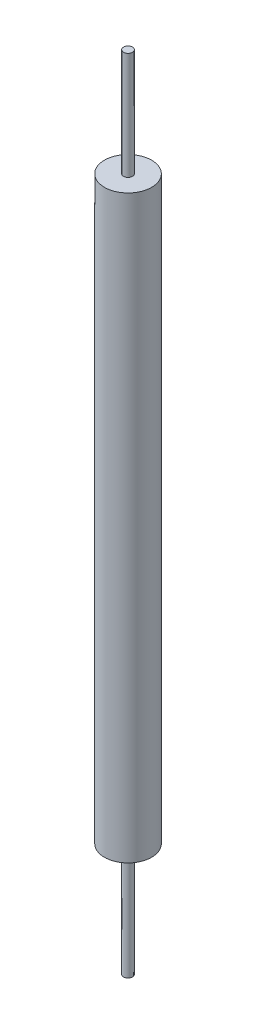
ISO-10303-21;
HEADER;
FILE_DESCRIPTION(('STEP AP214'),'2;1');
FILE_NAME('part.step','',(''),(''),'','','');
FILE_SCHEMA(('AUTOMOTIVE_DESIGN { 1 0 10303 214 1 1 1 1 }'));
ENDSEC;
DATA;
#1=APPLICATION_CONTEXT('core data for automotive mechanical design processes');
#2=APPLICATION_PROTOCOL_DEFINITION('international standard','automotive_design',2000,#1);
#3=PRODUCT_CONTEXT('',#1,'mechanical');
#4=PRODUCT('Part','Part','',(#3));
#5=PRODUCT_RELATED_PRODUCT_CATEGORY('part','',(#4));
#6=PRODUCT_DEFINITION_FORMATION('','',#4);
#7=PRODUCT_DEFINITION_CONTEXT('part definition',#1,'design');
#8=PRODUCT_DEFINITION('design','',#6,#7);
#9=PRODUCT_DEFINITION_SHAPE('','',#8);
#10=(LENGTH_UNIT() NAMED_UNIT(*) SI_UNIT(.MILLI.,.METRE.));
#11=(NAMED_UNIT(*) PLANE_ANGLE_UNIT() SI_UNIT($,.RADIAN.));
#12=(NAMED_UNIT(*) SI_UNIT($,.STERADIAN.) SOLID_ANGLE_UNIT());
#13=UNCERTAINTY_MEASURE_WITH_UNIT(LENGTH_MEASURE(1.E-05),#10,'distance_accuracy_value','');
#14=(GEOMETRIC_REPRESENTATION_CONTEXT(3) GLOBAL_UNCERTAINTY_ASSIGNED_CONTEXT((#13)) GLOBAL_UNIT_ASSIGNED_CONTEXT((#10,
#11,#12)) REPRESENTATION_CONTEXT('',''));
#15=CARTESIAN_POINT('',(0.,0.,0.));
#16=DIRECTION('',(0.,0.,1.));
#17=DIRECTION('',(1.,0.,0.));
#18=AXIS2_PLACEMENT_3D('',#15,#16,#17);
#19=CARTESIAN_POINT('',(0.,789.6,0.));
#20=DIRECTION('',(0.,-1.,0.));
#21=DIRECTION('',(0.,0.,-1.));
#22=AXIS2_PLACEMENT_3D('',#19,#20,#21);
#23=CYLINDRICAL_SURFACE('',#22,25.);
#24=CARTESIAN_POINT('',(-24.4803692447999,337.95,-5.07065297947487));
#25=CARTESIAN_POINT('',(-24.4803704267924,338.033065530407,-5.07064911676483));
#26=CARTESIAN_POINT('',(-24.4818068726829,338.116190178673,-5.06372760055706));
#27=CARTESIAN_POINT('',(-24.4874759549728,338.280119313694,-5.03623969692189));
#28=CARTESIAN_POINT('',(-24.4917118818056,338.360920953286,-5.01565725269049));
#29=CARTESIAN_POINT('',(-24.5027368802839,338.517779948416,-4.96151622023754));
#30=CARTESIAN_POINT('',(-24.5095234168622,338.593841927512,-4.9279705153522));
#31=CARTESIAN_POINT('',(-24.5252820496748,338.739204717167,-4.84893353769242));
#32=CARTESIAN_POINT('',(-24.5342537492403,338.808506751651,-4.80344443286503));
#33=CARTESIAN_POINT('',(-24.5540326777045,338.939239724926,-4.70129837287459));
#34=CARTESIAN_POINT('',(-24.5648585181909,339.000578516605,-4.64452713848332));
#35=CARTESIAN_POINT('',(-24.5877554160779,339.11290568262,-4.52174491900959));
#36=CARTESIAN_POINT('',(-24.5998266306454,339.163892748148,-4.45573276734266));
#37=CARTESIAN_POINT('',(-24.6249023775349,339.255018597438,-4.31501722372393));
#38=CARTESIAN_POINT('',(-24.6379198358369,339.294944640868,-4.24017830420548));
#39=CARTESIAN_POINT('',(-24.6641433208564,339.361635534538,-4.0848783618945));
#40=CARTESIAN_POINT('',(-24.6773493592774,339.38839956425,-4.00441698895161));
#41=CARTESIAN_POINT('',(-24.7035764924574,339.428207283448,-3.83931697725933));
#42=CARTESIAN_POINT('',(-24.7165946931602,339.441120008142,-3.75464625138994));
#43=CARTESIAN_POINT('',(-24.7418818433871,339.452367279242,-3.5842295946693));
#44=CARTESIAN_POINT('',(-24.7541508003015,339.450701969465,-3.49848367443349));
#45=CARTESIAN_POINT('',(-24.7775641211904,339.432797839342,-3.32861065498108));
#46=CARTESIAN_POINT('',(-24.7887114869051,339.416599134868,-3.24447975040534));
#47=CARTESIAN_POINT('',(-24.8096794134416,339.370071842725,-3.08004553588936));
#48=CARTESIAN_POINT('',(-24.8195000361463,339.339743914376,-2.99974204754115));
#49=CARTESIAN_POINT('',(-24.8375915214667,339.266108721899,-2.84604775343688));
#50=CARTESIAN_POINT('',(-24.8458757187957,339.222922526852,-2.7726005127615));
#51=CARTESIAN_POINT('',(-24.8609550304553,339.124664856472,-2.63396742531102));
#52=CARTESIAN_POINT('',(-24.8677502122082,339.0695939195,-2.56878120453549));
#53=CARTESIAN_POINT('',(-24.8798208254829,338.949624445389,-2.44910440002238));
#54=CARTESIAN_POINT('',(-24.885108288795,338.884810401376,-2.39453031236309));
#55=CARTESIAN_POINT('',(-24.8942986921019,338.746863743013,-2.29701960614495));
#56=CARTESIAN_POINT('',(-24.8982016667972,338.673731337213,-2.25408269592217));
#57=CARTESIAN_POINT('',(-24.9046861662216,338.521576783484,-2.1812711183625));
#58=CARTESIAN_POINT('',(-24.9072734714972,338.442582178173,-2.15133939718838));
#59=CARTESIAN_POINT('',(-24.9112214899481,338.280665675092,-2.10513329585162));
#60=CARTESIAN_POINT('',(-24.9125822155125,338.197743816999,-2.08885877774148));
#61=CARTESIAN_POINT('',(-24.9141185392938,338.03046832571,-2.07045509423179));
#62=CARTESIAN_POINT('',(-24.9142960195781,337.946117180329,-2.0683034650789));
#63=CARTESIAN_POINT('',(-24.9134767587728,337.778250503633,-2.07814802502549));
#64=CARTESIAN_POINT('',(-24.9124800222717,337.694734969054,-2.0901441588402));
#65=CARTESIAN_POINT('',(-24.9092807139069,337.530934942154,-2.12793089374339));
#66=CARTESIAN_POINT('',(-24.9070784906104,337.450649523043,-2.15371750725676));
#67=CARTESIAN_POINT('',(-24.9014063550025,337.29556033597,-2.21833434443576));
#68=CARTESIAN_POINT('',(-24.8979364462794,337.220756552491,-2.25716453117943));
#69=CARTESIAN_POINT('',(-24.889650712723,337.078706154892,-2.34676475551543));
#70=CARTESIAN_POINT('',(-24.8848341682303,337.011463608612,-2.39754117502047));
#71=CARTESIAN_POINT('',(-24.8737881741133,336.886471072753,-2.50954580184231));
#72=CARTESIAN_POINT('',(-24.8675587202911,336.828721111379,-2.57077404021256));
#73=CARTESIAN_POINT('',(-24.8536372629654,336.724201098244,-2.70204967939455));
#74=CARTESIAN_POINT('',(-24.8459421175316,336.677455125513,-2.77211591476229));
#75=CARTESIAN_POINT('',(-24.829121245653,336.596375565738,-2.9189367001778));
#76=CARTESIAN_POINT('',(-24.8199954902263,336.5620422302,-2.9956913857094));
#77=CARTESIAN_POINT('',(-24.8003609198475,336.506536441048,-3.15412404735377));
#78=CARTESIAN_POINT('',(-24.7898449013285,336.485436069496,-3.23582637474279));
#79=CARTESIAN_POINT('',(-24.7676617751902,336.457206775572,-3.40145710624222));
#80=CARTESIAN_POINT('',(-24.7559946086533,336.450078568707,-3.48538562413183));
#81=CARTESIAN_POINT('',(-24.73169011637,336.449922035599,-3.65387631992));
#82=CARTESIAN_POINT('',(-24.7190450914878,336.457019555396,-3.73843750194549));
#83=CARTESIAN_POINT('',(-24.6932658373663,336.485317098187,-3.90509104650278));
#84=CARTESIAN_POINT('',(-24.680131578104,336.506517988017,-3.98718325695974));
#85=CARTESIAN_POINT('',(-24.6537322653682,336.562653173938,-4.14730374588743));
#86=CARTESIAN_POINT('',(-24.6404670389214,336.597701177347,-4.22529215891913));
#87=CARTESIAN_POINT('',(-24.6144582672907,336.680560475987,-4.37426207848779));
#88=CARTESIAN_POINT('',(-24.6017147155293,336.728371610242,-4.44524367338432));
#89=CARTESIAN_POINT('',(-24.5773234515305,336.835472013344,-4.57818167207155));
#90=CARTESIAN_POINT('',(-24.5656758810786,336.894762764267,-4.64013690870232));
#91=CARTESIAN_POINT('',(-24.54405238671,337.023217592041,-4.75318994965592));
#92=CARTESIAN_POINT('',(-24.5340767691985,337.092383474334,-4.80428576432043));
#93=CARTESIAN_POINT('',(-24.5164396634024,337.237754252994,-4.89348912576956));
#94=CARTESIAN_POINT('',(-24.5087521361726,337.313865952268,-4.93174350667504));
#95=CARTESIAN_POINT('',(-24.4959709300234,337.471587956726,-4.99484287806743));
#96=CARTESIAN_POINT('',(-24.4908737995086,337.553190780064,-5.01970571488577));
#97=CARTESIAN_POINT('',(-24.4849498934101,337.6877964892,-5.04849934136941));
#98=CARTESIAN_POINT('',(-24.4832362152097,337.739867482485,-5.05679510872545));
#99=CARTESIAN_POINT('',(-24.4809455234018,337.844617723039,-5.06787311694184));
#100=CARTESIAN_POINT('',(-24.4803684948546,337.897296962305,-5.07065543026946));
#101=CARTESIAN_POINT('',(-24.4803692447999,337.95,-5.07065297947487));
#102=B_SPLINE_CURVE_WITH_KNOTS('',3,(#24,#25,#26,#27,#28,#29,#30,#31,#32,#33,#34,#35,#36,#37,
#38,#39,#40,#41,#42,#43,#44,#45,#46,#47,#48,#49,#50,#51,#52,#53,#54,#55,#56,#57,#58,#59,#60,#61,
#62,#63,#64,#65,#66,#67,#68,#69,#70,#71,#72,#73,#74,#75,#76,#77,#78,#79,#80,#81,#82,#83,#84,#85,
#86,#87,#88,#89,#90,#91,#92,#93,#94,#95,#96,#97,#98,#99,#100,#101),.UNSPECIFIED.,.T.,.F.,(4,2,2,
2,2,2,2,2,2,2,2,2,2,2,2,2,2,2,2,2,2,2,2,2,2,2,2,2,2,2,2,2,2,2,2,2,2,2,4),(0.,0.249001945926484,
0.498297083694083,0.747345097895768,0.996347936512632,1.24801489244597,1.49971364781627,
1.75596185578507,2.01222603640808,2.27089241077532,2.52955623332466,2.78750826699095,
3.04544826491379,3.30103251394289,3.55660518779143,3.8100773114816,4.063543081783,
4.31588538445415,4.56822513825694,4.82016342501577,5.07210072728644,5.32396522018533,
5.57582900014678,5.82782763744581,6.0798270234719,6.33237281482185,6.58492372302666,
6.83883863274658,7.0927665449987,7.34895071165685,7.60515062564433,7.86349960520935,
8.1218453264446,8.38022442367181,8.63865082026517,8.89401271033177,9.14903344332431,
9.30702113531295,9.46500675074265),.UNSPECIFIED.);
#103=CARTESIAN_POINT('',(-24.4803692447999,337.95,-5.07065297947487));
#104=VERTEX_POINT('',#103);
#105=EDGE_CURVE('E35',#104,#104,#102,.T.);
#106=ORIENTED_EDGE('',*,*,#105,.T.);
#107=EDGE_LOOP('',(#106));
#108=FACE_BOUND('',#107,.T.);
#109=CARTESIAN_POINT('',(0.,715.6,0.));
#110=DIRECTION('',(0.,1.,0.));
#111=DIRECTION('',(0.,0.,1.));
#112=AXIS2_PLACEMENT_3D('',#109,#110,#111);
#113=CIRCLE('',#112,25.);
#114=CARTESIAN_POINT('',(0.,715.6,25.));
#115=VERTEX_POINT('',#114);
#116=EDGE_CURVE('E10',#115,#115,#113,.T.);
#117=ORIENTED_EDGE('',*,*,#116,.F.);
#118=EDGE_LOOP('',(#117));
#119=FACE_BOUND('',#118,.T.);
#120=CARTESIAN_POINT('',(0.,100.,0.));
#121=DIRECTION('',(0.,-1.,0.));
#122=DIRECTION('',(0.,0.,-1.));
#123=AXIS2_PLACEMENT_3D('',#120,#121,#122);
#124=CIRCLE('',#123,25.);
#125=CARTESIAN_POINT('',(0.,100.,-25.));
#126=VERTEX_POINT('',#125);
#127=EDGE_CURVE('E47',#126,#126,#124,.T.);
#128=ORIENTED_EDGE('',*,*,#127,.F.);
#129=EDGE_LOOP('',(#128));
#130=FACE_BOUND('',#129,.T.);
#131=ADVANCED_FACE('F31',(#108,#119,#130),#23,.T.);
#132=CARTESIAN_POINT('',(0.,715.6,0.));
#133=DIRECTION('',(0.,1.,0.));
#134=DIRECTION('',(0.,0.,1.));
#135=AXIS2_PLACEMENT_3D('',#132,#133,#134);
#136=PLANE('',#135);
#137=CARTESIAN_POINT('',(0.,715.6,0.));
#138=DIRECTION('',(0.,1.,0.));
#139=DIRECTION('',(0.,0.,1.));
#140=AXIS2_PLACEMENT_3D('',#137,#138,#139);
#141=CIRCLE('',#140,4.7625);
#142=CARTESIAN_POINT('',(0.,715.6,4.7625));
#143=VERTEX_POINT('',#142);
#144=EDGE_CURVE('E43',#143,#143,#141,.T.);
#145=ORIENTED_EDGE('',*,*,#144,.F.);
#146=EDGE_LOOP('',(#145));
#147=FACE_BOUND('',#146,.T.);
#148=ORIENTED_EDGE('',*,*,#116,.T.);
#149=EDGE_LOOP('',(#148));
#150=FACE_BOUND('',#149,.T.);
#151=ADVANCED_FACE('F70',(#147,#150),#136,.T.);
#152=CARTESIAN_POINT('',(0.,715.6,0.));
#153=DIRECTION('',(0.,1.,0.));
#154=DIRECTION('',(0.,0.,1.));
#155=AXIS2_PLACEMENT_3D('',#152,#153,#154);
#156=CYLINDRICAL_SURFACE('',#155,4.7625);
#157=ORIENTED_EDGE('',*,*,#144,.T.);
#158=EDGE_LOOP('',(#157));
#159=FACE_BOUND('',#158,.T.);
#160=CARTESIAN_POINT('',(0.,829.6,0.));
#161=DIRECTION('',(0.,1.,0.));
#162=DIRECTION('',(0.,0.,1.));
#163=AXIS2_PLACEMENT_3D('',#160,#161,#162);
#164=CIRCLE('',#163,4.7625);
#165=CARTESIAN_POINT('',(0.,829.6,4.7625));
#166=VERTEX_POINT('',#165);
#167=EDGE_CURVE('E61',#166,#166,#164,.T.);
#168=ORIENTED_EDGE('',*,*,#167,.F.);
#169=EDGE_LOOP('',(#168));
#170=FACE_BOUND('',#169,.T.);
#171=ADVANCED_FACE('F67',(#159,#170),#156,.T.);
#172=CARTESIAN_POINT('',(0.,100.,0.));
#173=DIRECTION('',(0.,-1.,0.));
#174=DIRECTION('',(0.,0.,-1.));
#175=AXIS2_PLACEMENT_3D('',#172,#173,#174);
#176=PLANE('',#175);
#177=CARTESIAN_POINT('',(0.,100.,0.));
#178=DIRECTION('',(0.,-1.,0.));
#179=DIRECTION('',(0.,0.,-1.));
#180=AXIS2_PLACEMENT_3D('',#177,#178,#179);
#181=CIRCLE('',#180,4.7625);
#182=CARTESIAN_POINT('',(0.,100.,-4.7625));
#183=VERTEX_POINT('',#182);
#184=EDGE_CURVE('E52',#183,#183,#181,.T.);
#185=ORIENTED_EDGE('',*,*,#184,.F.);
#186=EDGE_LOOP('',(#185));
#187=FACE_BOUND('',#186,.T.);
#188=ORIENTED_EDGE('',*,*,#127,.T.);
#189=EDGE_LOOP('',(#188));
#190=FACE_BOUND('',#189,.T.);
#191=ADVANCED_FACE('F69',(#187,#190),#176,.T.);
#192=CARTESIAN_POINT('',(0.,100.,0.));
#193=DIRECTION('',(0.,-1.,0.));
#194=DIRECTION('',(0.,0.,-1.));
#195=AXIS2_PLACEMENT_3D('',#192,#193,#194);
#196=CYLINDRICAL_SURFACE('',#195,4.7625);
#197=ORIENTED_EDGE('',*,*,#184,.T.);
#198=EDGE_LOOP('',(#197));
#199=FACE_BOUND('',#198,.T.);
#200=CARTESIAN_POINT('',(0.,-20.,0.));
#201=DIRECTION('',(0.,-1.,0.));
#202=DIRECTION('',(0.,0.,-1.));
#203=AXIS2_PLACEMENT_3D('',#200,#201,#202);
#204=CIRCLE('',#203,4.7625);
#205=CARTESIAN_POINT('',(0.,-20.,-4.7625));
#206=VERTEX_POINT('',#205);
#207=EDGE_CURVE('E58',#206,#206,#204,.T.);
#208=ORIENTED_EDGE('',*,*,#207,.F.);
#209=EDGE_LOOP('',(#208));
#210=FACE_BOUND('',#209,.T.);
#211=ADVANCED_FACE('F77',(#199,#210),#196,.T.);
#212=CARTESIAN_POINT('',(-30.,337.95,-3.5706529794749));
#213=DIRECTION('',(1.,0.,0.));
#214=DIRECTION('',(0.,0.,-1.));
#215=AXIS2_PLACEMENT_3D('',#212,#213,#214);
#216=CYLINDRICAL_SURFACE('',#215,1.49999999999997);
#217=CARTESIAN_POINT('',(0.,337.95,-3.5706529794749));
#218=DIRECTION('',(1.,0.,0.));
#219=DIRECTION('',(0.,0.,-1.));
#220=AXIS2_PLACEMENT_3D('',#217,#218,#219);
#221=CIRCLE('',#220,1.49999999999997);
#222=CARTESIAN_POINT('',(0.,337.95,-5.07065297947487));
#223=VERTEX_POINT('',#222);
#224=EDGE_CURVE('E55',#223,#223,#221,.T.);
#225=ORIENTED_EDGE('',*,*,#224,.T.);
#226=EDGE_LOOP('',(#225));
#227=FACE_BOUND('',#226,.T.);
#228=ORIENTED_EDGE('',*,*,#105,.F.);
#229=EDGE_LOOP('',(#228));
#230=FACE_BOUND('',#229,.T.);
#231=ADVANCED_FACE('F92',(#227,#230),#216,.F.);
#232=CARTESIAN_POINT('',(0.,337.95,-3.5706529794749));
#233=DIRECTION('',(1.,0.,0.));
#234=DIRECTION('',(0.,0.,-1.));
#235=AXIS2_PLACEMENT_3D('',#232,#233,#234);
#236=PLANE('',#235);
#237=ORIENTED_EDGE('',*,*,#224,.F.);
#238=EDGE_LOOP('',(#237));
#239=FACE_BOUND('',#238,.T.);
#240=ADVANCED_FACE('F94',(#239),#236,.F.);
#241=CARTESIAN_POINT('',(0.,-20.,0.));
#242=DIRECTION('',(0.,-1.,0.));
#243=DIRECTION('',(0.,0.,-1.));
#244=AXIS2_PLACEMENT_3D('',#241,#242,#243);
#245=PLANE('',#244);
#246=ORIENTED_EDGE('',*,*,#207,.T.);
#247=EDGE_LOOP('',(#246));
#248=FACE_BOUND('',#247,.T.);
#249=ADVANCED_FACE('F100',(#248),#245,.T.);
#250=CARTESIAN_POINT('',(0.,829.6,0.));
#251=DIRECTION('',(0.,1.,0.));
#252=DIRECTION('',(0.,0.,1.));
#253=AXIS2_PLACEMENT_3D('',#250,#251,#252);
#254=PLANE('',#253);
#255=ORIENTED_EDGE('',*,*,#167,.T.);
#256=EDGE_LOOP('',(#255));
#257=FACE_BOUND('',#256,.T.);
#258=ADVANCED_FACE('F65',(#257),#254,.T.);
#259=CLOSED_SHELL('',(#131,#151,#171,#191,#211,#231,#240,#249,#258));
#260=MANIFOLD_SOLID_BREP('B2',#259);
#261=ADVANCED_BREP_SHAPE_REPRESENTATION('',(#18,#260),#14);
#262=SHAPE_DEFINITION_REPRESENTATION(#9,#261);
ENDSEC;
END-ISO-10303-21;
